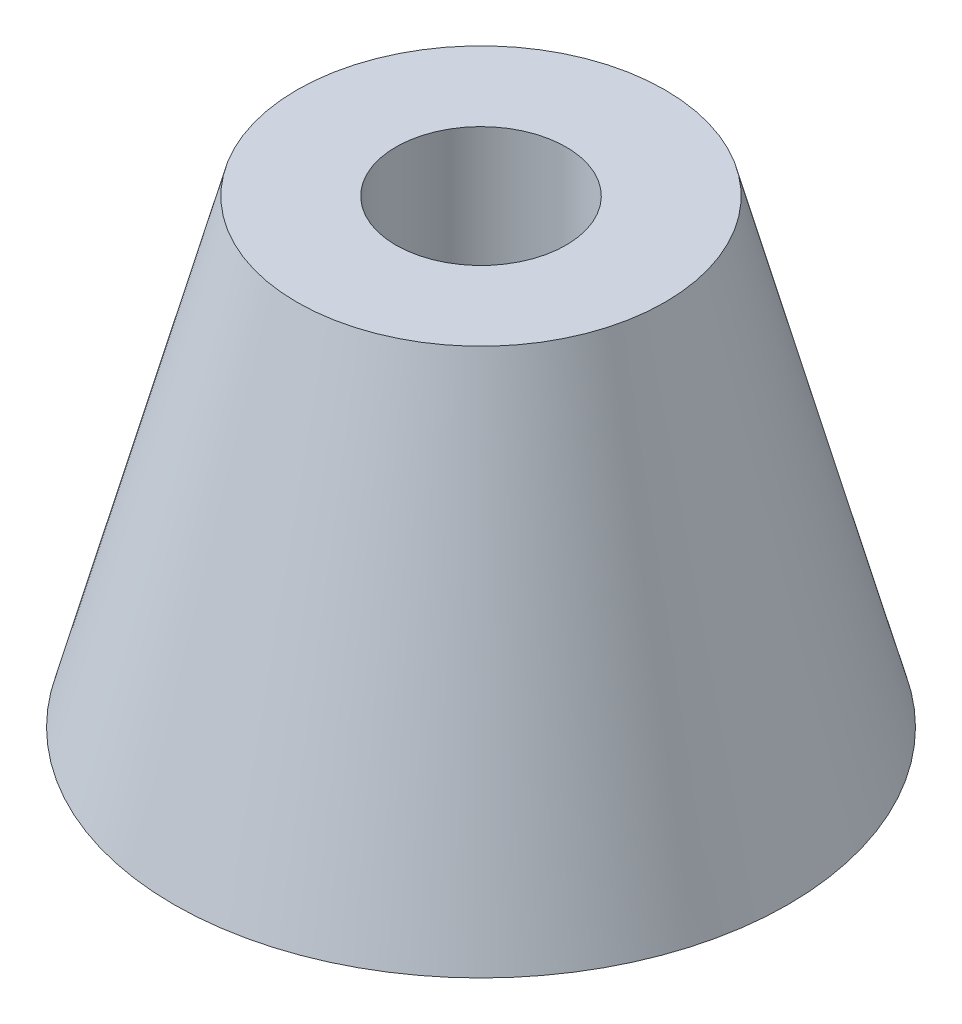
ISO-10303-21;
HEADER;
FILE_DESCRIPTION(('STEP AP214'),'2;1');
FILE_NAME('part.step','',(''),(''),'','','');
FILE_SCHEMA(('AUTOMOTIVE_DESIGN { 1 0 10303 214 1 1 1 1 }'));
ENDSEC;
DATA;
#1=APPLICATION_CONTEXT('core data for automotive mechanical design processes');
#2=APPLICATION_PROTOCOL_DEFINITION('international standard','automotive_design',2000,#1);
#3=PRODUCT_CONTEXT('',#1,'mechanical');
#4=PRODUCT('Part','Part','',(#3));
#5=PRODUCT_RELATED_PRODUCT_CATEGORY('part','',(#4));
#6=PRODUCT_DEFINITION_FORMATION('','',#4);
#7=PRODUCT_DEFINITION_CONTEXT('part definition',#1,'design');
#8=PRODUCT_DEFINITION('design','',#6,#7);
#9=PRODUCT_DEFINITION_SHAPE('','',#8);
#10=(LENGTH_UNIT() NAMED_UNIT(*) SI_UNIT(.MILLI.,.METRE.));
#11=(NAMED_UNIT(*) PLANE_ANGLE_UNIT() SI_UNIT($,.RADIAN.));
#12=(NAMED_UNIT(*) SI_UNIT($,.STERADIAN.) SOLID_ANGLE_UNIT());
#13=UNCERTAINTY_MEASURE_WITH_UNIT(LENGTH_MEASURE(1.E-05),#10,'distance_accuracy_value','');
#14=(GEOMETRIC_REPRESENTATION_CONTEXT(3) GLOBAL_UNCERTAINTY_ASSIGNED_CONTEXT((#13)) GLOBAL_UNIT_ASSIGNED_CONTEXT((#10,
#11,#12)) REPRESENTATION_CONTEXT('',''));
#15=CARTESIAN_POINT('',(0.,0.,0.));
#16=DIRECTION('',(0.,0.,1.));
#17=DIRECTION('',(1.,0.,0.));
#18=AXIS2_PLACEMENT_3D('',#15,#16,#17);
#19=CARTESIAN_POINT('',(0.,0.,0.));
#20=DIRECTION('',(0.,-1.,0.));
#21=DIRECTION('',(0.,0.,1.));
#22=AXIS2_PLACEMENT_3D('',#19,#20,#21);
#23=CONICAL_SURFACE('',#22,4.,0.26179938779915);
#24=CARTESIAN_POINT('',(0.,-10.,0.));
#25=DIRECTION('',(0.,1.,0.));
#26=DIRECTION('',(0.,0.,1.));
#27=AXIS2_PLACEMENT_3D('',#24,#25,#26);
#28=CIRCLE('',#27,6.67949192431123);
#29=CARTESIAN_POINT('',(0.,-10.,6.67949192431123));
#30=VERTEX_POINT('',#29);
#31=EDGE_CURVE('E10',#30,#30,#28,.T.);
#32=ORIENTED_EDGE('',*,*,#31,.T.);
#33=EDGE_LOOP('',(#32));
#34=FACE_BOUND('',#33,.T.);
#35=CARTESIAN_POINT('',(0.,0.,0.));
#36=DIRECTION('',(0.,1.,0.));
#37=DIRECTION('',(0.,0.,1.));
#38=AXIS2_PLACEMENT_3D('',#35,#36,#37);
#39=CIRCLE('',#38,4.);
#40=CARTESIAN_POINT('',(0.,0.,4.));
#41=VERTEX_POINT('',#40);
#42=EDGE_CURVE('E39',#41,#41,#39,.T.);
#43=ORIENTED_EDGE('',*,*,#42,.F.);
#44=EDGE_LOOP('',(#43));
#45=FACE_BOUND('',#44,.T.);
#46=ADVANCED_FACE('F33',(#34,#45),#23,.T.);
#47=CARTESIAN_POINT('',(0.,-10.,0.));
#48=DIRECTION('',(0.,1.,0.));
#49=DIRECTION('',(0.,0.,1.));
#50=AXIS2_PLACEMENT_3D('',#47,#48,#49);
#51=PLANE('',#50);
#52=CARTESIAN_POINT('',(0.,-10.,0.));
#53=DIRECTION('',(0.,1.,0.));
#54=DIRECTION('',(0.,0.,1.));
#55=AXIS2_PLACEMENT_3D('',#52,#53,#54);
#56=CIRCLE('',#55,1.85);
#57=CARTESIAN_POINT('',(0.,-10.,1.85));
#58=VERTEX_POINT('',#57);
#59=EDGE_CURVE('E43',#58,#58,#56,.T.);
#60=ORIENTED_EDGE('',*,*,#59,.T.);
#61=EDGE_LOOP('',(#60));
#62=FACE_BOUND('',#61,.T.);
#63=ORIENTED_EDGE('',*,*,#31,.F.);
#64=EDGE_LOOP('',(#63));
#65=FACE_BOUND('',#64,.T.);
#66=ADVANCED_FACE('F57',(#62,#65),#51,.F.);
#67=CARTESIAN_POINT('',(0.,0.,0.));
#68=DIRECTION('',(0.,1.,0.));
#69=DIRECTION('',(0.,0.,1.));
#70=AXIS2_PLACEMENT_3D('',#67,#68,#69);
#71=PLANE('',#70);
#72=CARTESIAN_POINT('',(0.,0.,0.));
#73=DIRECTION('',(0.,1.,0.));
#74=DIRECTION('',(0.,0.,1.));
#75=AXIS2_PLACEMENT_3D('',#72,#73,#74);
#76=CIRCLE('',#75,1.85);
#77=CARTESIAN_POINT('',(0.,0.,1.85));
#78=VERTEX_POINT('',#77);
#79=EDGE_CURVE('E47',#78,#78,#76,.T.);
#80=ORIENTED_EDGE('',*,*,#79,.F.);
#81=EDGE_LOOP('',(#80));
#82=FACE_BOUND('',#81,.T.);
#83=ORIENTED_EDGE('',*,*,#42,.T.);
#84=EDGE_LOOP('',(#83));
#85=FACE_BOUND('',#84,.T.);
#86=ADVANCED_FACE('F55',(#82,#85),#71,.T.);
#87=CARTESIAN_POINT('',(0.,-10.,0.));
#88=DIRECTION('',(0.,1.,0.));
#89=DIRECTION('',(0.,0.,1.));
#90=AXIS2_PLACEMENT_3D('',#87,#88,#89);
#91=CYLINDRICAL_SURFACE('',#90,1.85);
#92=ORIENTED_EDGE('',*,*,#59,.F.);
#93=EDGE_LOOP('',(#92));
#94=FACE_BOUND('',#93,.T.);
#95=ORIENTED_EDGE('',*,*,#79,.T.);
#96=EDGE_LOOP('',(#95));
#97=FACE_BOUND('',#96,.T.);
#98=ADVANCED_FACE('F53',(#94,#97),#91,.F.);
#99=CLOSED_SHELL('',(#46,#66,#86,#98));
#100=MANIFOLD_SOLID_BREP('B2',#99);
#101=ADVANCED_BREP_SHAPE_REPRESENTATION('',(#18,#100),#14);
#102=SHAPE_DEFINITION_REPRESENTATION(#9,#101);
ENDSEC;
END-ISO-10303-21;
